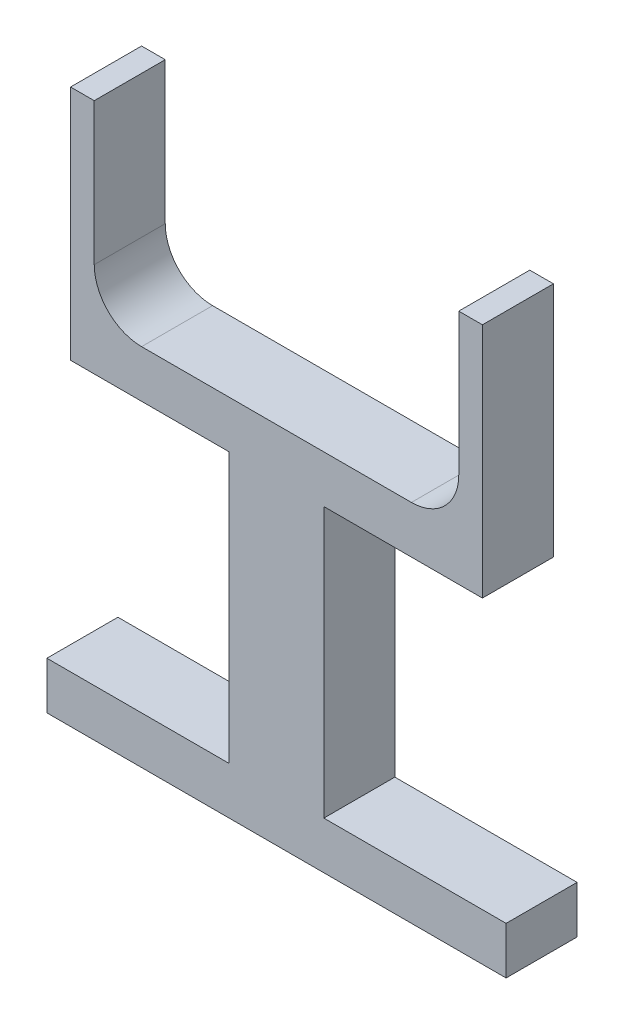
ISO-10303-21;
HEADER;
FILE_DESCRIPTION(('STEP AP214'),'2;1');
FILE_NAME('part.step','',(''),(''),'','','');
FILE_SCHEMA(('AUTOMOTIVE_DESIGN { 1 0 10303 214 1 1 1 1 }'));
ENDSEC;
DATA;
#1=APPLICATION_CONTEXT('core data for automotive mechanical design processes');
#2=APPLICATION_PROTOCOL_DEFINITION('international standard','automotive_design',2000,#1);
#3=PRODUCT_CONTEXT('',#1,'mechanical');
#4=PRODUCT('Part','Part','',(#3));
#5=PRODUCT_RELATED_PRODUCT_CATEGORY('part','',(#4));
#6=PRODUCT_DEFINITION_FORMATION('','',#4);
#7=PRODUCT_DEFINITION_CONTEXT('part definition',#1,'design');
#8=PRODUCT_DEFINITION('design','',#6,#7);
#9=PRODUCT_DEFINITION_SHAPE('','',#8);
#10=(LENGTH_UNIT() NAMED_UNIT(*) SI_UNIT(.MILLI.,.METRE.));
#11=(NAMED_UNIT(*) PLANE_ANGLE_UNIT() SI_UNIT($,.RADIAN.));
#12=(NAMED_UNIT(*) SI_UNIT($,.STERADIAN.) SOLID_ANGLE_UNIT());
#13=UNCERTAINTY_MEASURE_WITH_UNIT(LENGTH_MEASURE(1.E-05),#10,'distance_accuracy_value','');
#14=(GEOMETRIC_REPRESENTATION_CONTEXT(3) GLOBAL_UNCERTAINTY_ASSIGNED_CONTEXT((#13)) GLOBAL_UNIT_ASSIGNED_CONTEXT((#10,
#11,#12)) REPRESENTATION_CONTEXT('',''));
#15=CARTESIAN_POINT('',(0.,0.,0.));
#16=DIRECTION('',(0.,0.,1.));
#17=DIRECTION('',(1.,0.,0.));
#18=AXIS2_PLACEMENT_3D('',#15,#16,#17);
#19=CARTESIAN_POINT('',(-72.3723164960141,0.,15.));
#20=DIRECTION('',(-1.,0.,0.));
#21=DIRECTION('',(0.,-1.,0.));
#22=AXIS2_PLACEMENT_3D('',#19,#20,#21);
#23=PLANE('',#22);
#24=DIRECTION('',(0.,1.,0.));
#25=VECTOR('',#24,1.);
#26=CARTESIAN_POINT('',(-72.3723164960141,0.,0.));
#27=LINE('',#26,#25);
#28=CARTESIAN_POINT('',(-72.3723164960141,45.7704918032787,0.));
#29=VERTEX_POINT('',#28);
#30=CARTESIAN_POINT('',(-72.3723164960141,95.7704918032787,0.));
#31=VERTEX_POINT('',#30);
#32=EDGE_CURVE('E172',#29,#31,#27,.T.);
#33=ORIENTED_EDGE('',*,*,#32,.F.);
#34=DIRECTION('',(0.,0.,-1.));
#35=VECTOR('',#34,1.);
#36=CARTESIAN_POINT('',(-72.3723164960141,45.7704918032787,15.));
#37=LINE('',#36,#35);
#38=CARTESIAN_POINT('',(-72.3723164960141,45.7704918032787,15.));
#39=VERTEX_POINT('',#38);
#40=EDGE_CURVE('E166',#39,#29,#37,.T.);
#41=ORIENTED_EDGE('',*,*,#40,.F.);
#42=DIRECTION('',(0.,1.,0.));
#43=VECTOR('',#42,1.);
#44=CARTESIAN_POINT('',(-72.3723164960141,0.,15.));
#45=LINE('',#44,#43);
#46=CARTESIAN_POINT('',(-72.3723164960141,95.7704918032787,15.));
#47=VERTEX_POINT('',#46);
#48=EDGE_CURVE('E169',#39,#47,#45,.T.);
#49=ORIENTED_EDGE('',*,*,#48,.T.);
#50=DIRECTION('',(0.,0.,-1.));
#51=VECTOR('',#50,1.);
#52=CARTESIAN_POINT('',(-72.3723164960141,95.7704918032787,15.));
#53=LINE('',#52,#51);
#54=EDGE_CURVE('E240',#47,#31,#53,.T.);
#55=ORIENTED_EDGE('',*,*,#54,.T.);
#56=EDGE_LOOP('',(#33,#41,#49,#55));
#57=FACE_BOUND('',#56,.T.);
#58=ADVANCED_FACE('F41',(#57),#23,.T.);
#59=CARTESIAN_POINT('',(0.,45.7704918032787,15.));
#60=DIRECTION('',(0.,1.,0.));
#61=DIRECTION('',(0.,0.,1.));
#62=AXIS2_PLACEMENT_3D('',#59,#60,#61);
#63=PLANE('',#62);
#64=DIRECTION('',(1.,0.,0.));
#65=VECTOR('',#64,1.);
#66=CARTESIAN_POINT('',(0.,45.7704918032787,0.));
#67=LINE('',#66,#65);
#68=CARTESIAN_POINT('',(-38.8723164960141,45.7704918032787,0.));
#69=VERTEX_POINT('',#68);
#70=EDGE_CURVE('E243',#29,#69,#67,.T.);
#71=ORIENTED_EDGE('',*,*,#70,.T.);
#72=DIRECTION('',(0.,0.,-1.));
#73=VECTOR('',#72,1.);
#74=CARTESIAN_POINT('',(-38.8723164960141,45.7704918032787,15.));
#75=LINE('',#74,#73);
#76=CARTESIAN_POINT('',(-38.8723164960141,45.7704918032787,15.));
#77=VERTEX_POINT('',#76);
#78=EDGE_CURVE('E177',#77,#69,#75,.T.);
#79=ORIENTED_EDGE('',*,*,#78,.F.);
#80=DIRECTION('',(1.,0.,0.));
#81=VECTOR('',#80,1.);
#82=CARTESIAN_POINT('',(0.,45.7704918032787,15.));
#83=LINE('',#82,#81);
#84=EDGE_CURVE('E180',#39,#77,#83,.T.);
#85=ORIENTED_EDGE('',*,*,#84,.F.);
#86=ORIENTED_EDGE('',*,*,#40,.T.);
#87=EDGE_LOOP('',(#71,#79,#85,#86));
#88=FACE_BOUND('',#87,.T.);
#89=ADVANCED_FACE('F181',(#88),#63,.F.);
#90=CARTESIAN_POINT('',(-38.8723164960141,0.,15.));
#91=DIRECTION('',(1.,0.,0.));
#92=DIRECTION('',(0.,1.,0.));
#93=AXIS2_PLACEMENT_3D('',#90,#91,#92);
#94=PLANE('',#93);
#95=DIRECTION('',(0.,-1.,0.));
#96=VECTOR('',#95,1.);
#97=CARTESIAN_POINT('',(-38.8723164960141,0.,0.));
#98=LINE('',#97,#96);
#99=CARTESIAN_POINT('',(-38.8723164960141,-11.2295081967213,0.));
#100=VERTEX_POINT('',#99);
#101=EDGE_CURVE('E246',#69,#100,#98,.T.);
#102=ORIENTED_EDGE('',*,*,#101,.T.);
#103=DIRECTION('',(0.,0.,-1.));
#104=VECTOR('',#103,1.);
#105=CARTESIAN_POINT('',(-38.8723164960141,-11.2295081967213,15.));
#106=LINE('',#105,#104);
#107=CARTESIAN_POINT('',(-38.8723164960141,-11.2295081967213,15.));
#108=VERTEX_POINT('',#107);
#109=EDGE_CURVE('E323',#108,#100,#106,.T.);
#110=ORIENTED_EDGE('',*,*,#109,.F.);
#111=DIRECTION('',(0.,-1.,0.));
#112=VECTOR('',#111,1.);
#113=CARTESIAN_POINT('',(-38.8723164960141,0.,15.));
#114=LINE('',#113,#112);
#115=EDGE_CURVE('E185',#77,#108,#114,.T.);
#116=ORIENTED_EDGE('',*,*,#115,.F.);
#117=ORIENTED_EDGE('',*,*,#78,.T.);
#118=EDGE_LOOP('',(#102,#110,#116,#117));
#119=FACE_BOUND('',#118,.T.);
#120=ADVANCED_FACE('F361',(#119),#94,.F.);
#121=CARTESIAN_POINT('',(0.,-11.2295081967213,15.));
#122=DIRECTION('',(0.,1.,0.));
#123=DIRECTION('',(-1.,0.,0.));
#124=AXIS2_PLACEMENT_3D('',#121,#122,#123);
#125=PLANE('',#124);
#126=DIRECTION('',(1.,0.,0.));
#127=VECTOR('',#126,1.);
#128=CARTESIAN_POINT('',(0.,-11.2295081967213,0.));
#129=LINE('',#128,#127);
#130=CARTESIAN_POINT('',(-77.3723164960141,-11.2295081967213,0.));
#131=VERTEX_POINT('',#130);
#132=EDGE_CURVE('E251',#131,#100,#129,.T.);
#133=ORIENTED_EDGE('',*,*,#132,.F.);
#134=DIRECTION('',(0.,0.,-1.));
#135=VECTOR('',#134,1.);
#136=CARTESIAN_POINT('',(-77.3723164960141,-11.2295081967213,15.));
#137=LINE('',#136,#135);
#138=CARTESIAN_POINT('',(-77.3723164960141,-11.2295081967213,15.));
#139=VERTEX_POINT('',#138);
#140=EDGE_CURVE('E320',#139,#131,#137,.T.);
#141=ORIENTED_EDGE('',*,*,#140,.F.);
#142=DIRECTION('',(1.,0.,0.));
#143=VECTOR('',#142,1.);
#144=CARTESIAN_POINT('',(0.,-11.2295081967213,15.));
#145=LINE('',#144,#143);
#146=EDGE_CURVE('E201',#139,#108,#145,.T.);
#147=ORIENTED_EDGE('',*,*,#146,.T.);
#148=ORIENTED_EDGE('',*,*,#109,.T.);
#149=EDGE_LOOP('',(#133,#141,#147,#148));
#150=FACE_BOUND('',#149,.T.);
#151=ADVANCED_FACE('F368',(#150),#125,.T.);
#152=CARTESIAN_POINT('',(-77.3723164960141,0.,15.));
#153=DIRECTION('',(1.,0.,0.));
#154=DIRECTION('',(0.,0.,-1.));
#155=AXIS2_PLACEMENT_3D('',#152,#153,#154);
#156=PLANE('',#155);
#157=DIRECTION('',(0.,-1.,0.));
#158=VECTOR('',#157,1.);
#159=CARTESIAN_POINT('',(-77.3723164960141,0.,0.));
#160=LINE('',#159,#158);
#161=CARTESIAN_POINT('',(-77.3723164960141,-21.2295081967213,0.));
#162=VERTEX_POINT('',#161);
#163=EDGE_CURVE('E255',#131,#162,#160,.T.);
#164=ORIENTED_EDGE('',*,*,#163,.T.);
#165=DIRECTION('',(0.,0.,-1.));
#166=VECTOR('',#165,1.);
#167=CARTESIAN_POINT('',(-77.3723164960141,-21.2295081967213,15.));
#168=LINE('',#167,#166);
#169=CARTESIAN_POINT('',(-77.3723164960141,-21.2295081967213,15.));
#170=VERTEX_POINT('',#169);
#171=EDGE_CURVE('E316',#170,#162,#168,.T.);
#172=ORIENTED_EDGE('',*,*,#171,.F.);
#173=DIRECTION('',(0.,-1.,0.));
#174=VECTOR('',#173,1.);
#175=CARTESIAN_POINT('',(-77.3723164960141,0.,15.));
#176=LINE('',#175,#174);
#177=EDGE_CURVE('E205',#139,#170,#176,.T.);
#178=ORIENTED_EDGE('',*,*,#177,.F.);
#179=ORIENTED_EDGE('',*,*,#140,.T.);
#180=EDGE_LOOP('',(#164,#172,#178,#179));
#181=FACE_BOUND('',#180,.T.);
#182=ADVANCED_FACE('F371',(#181),#156,.F.);
#183=CARTESIAN_POINT('',(0.,-21.2295081967213,15.));
#184=DIRECTION('',(0.,1.,0.));
#185=DIRECTION('',(0.,0.,1.));
#186=AXIS2_PLACEMENT_3D('',#183,#184,#185);
#187=PLANE('',#186);
#188=DIRECTION('',(1.,0.,0.));
#189=VECTOR('',#188,1.);
#190=CARTESIAN_POINT('',(0.,-21.2295081967213,0.));
#191=LINE('',#190,#189);
#192=CARTESIAN_POINT('',(19.6276835039859,-21.2295081967213,0.));
#193=VERTEX_POINT('',#192);
#194=EDGE_CURVE('E259',#162,#193,#191,.T.);
#195=ORIENTED_EDGE('',*,*,#194,.T.);
#196=DIRECTION('',(0.,0.,-1.));
#197=VECTOR('',#196,1.);
#198=CARTESIAN_POINT('',(19.6276835039859,-21.2295081967213,15.));
#199=LINE('',#198,#197);
#200=CARTESIAN_POINT('',(19.6276835039859,-21.2295081967213,15.));
#201=VERTEX_POINT('',#200);
#202=EDGE_CURVE('E313',#201,#193,#199,.T.);
#203=ORIENTED_EDGE('',*,*,#202,.F.);
#204=DIRECTION('',(1.,0.,0.));
#205=VECTOR('',#204,1.);
#206=CARTESIAN_POINT('',(0.,-21.2295081967213,15.));
#207=LINE('',#206,#205);
#208=EDGE_CURVE('E209',#170,#201,#207,.T.);
#209=ORIENTED_EDGE('',*,*,#208,.F.);
#210=ORIENTED_EDGE('',*,*,#171,.T.);
#211=EDGE_LOOP('',(#195,#203,#209,#210));
#212=FACE_BOUND('',#211,.T.);
#213=ADVANCED_FACE('F376',(#212),#187,.F.);
#214=CARTESIAN_POINT('',(19.6276835039859,0.,15.));
#215=DIRECTION('',(1.,0.,0.));
#216=DIRECTION('',(0.,0.,-1.));
#217=AXIS2_PLACEMENT_3D('',#214,#215,#216);
#218=PLANE('',#217);
#219=DIRECTION('',(0.,-1.,0.));
#220=VECTOR('',#219,1.);
#221=CARTESIAN_POINT('',(19.6276835039859,0.,0.));
#222=LINE('',#221,#220);
#223=CARTESIAN_POINT('',(19.6276835039859,-11.2295081967213,0.));
#224=VERTEX_POINT('',#223);
#225=EDGE_CURVE('E263',#224,#193,#222,.T.);
#226=ORIENTED_EDGE('',*,*,#225,.F.);
#227=DIRECTION('',(0.,0.,-1.));
#228=VECTOR('',#227,1.);
#229=CARTESIAN_POINT('',(19.6276835039859,-11.2295081967213,15.));
#230=LINE('',#229,#228);
#231=CARTESIAN_POINT('',(19.6276835039859,-11.2295081967213,15.));
#232=VERTEX_POINT('',#231);
#233=EDGE_CURVE('E310',#232,#224,#230,.T.);
#234=ORIENTED_EDGE('',*,*,#233,.F.);
#235=DIRECTION('',(0.,-1.,0.));
#236=VECTOR('',#235,1.);
#237=CARTESIAN_POINT('',(19.6276835039859,0.,15.));
#238=LINE('',#237,#236);
#239=EDGE_CURVE('E212',#232,#201,#238,.T.);
#240=ORIENTED_EDGE('',*,*,#239,.T.);
#241=ORIENTED_EDGE('',*,*,#202,.T.);
#242=EDGE_LOOP('',(#226,#234,#240,#241));
#243=FACE_BOUND('',#242,.T.);
#244=ADVANCED_FACE('F417',(#243),#218,.T.);
#245=CARTESIAN_POINT('',(-18.8723164960141,-11.2295081967213,0.));
#246=VERTEX_POINT('',#245);
#247=EDGE_CURVE('E256',#246,#224,#129,.T.);
#248=ORIENTED_EDGE('',*,*,#247,.F.);
#249=DIRECTION('',(0.,0.,-1.));
#250=VECTOR('',#249,1.);
#251=CARTESIAN_POINT('',(-18.8723164960141,-11.2295081967213,15.));
#252=LINE('',#251,#250);
#253=CARTESIAN_POINT('',(-18.8723164960141,-11.2295081967213,15.));
#254=VERTEX_POINT('',#253);
#255=EDGE_CURVE('E307',#254,#246,#252,.T.);
#256=ORIENTED_EDGE('',*,*,#255,.F.);
#257=EDGE_CURVE('E206',#254,#232,#145,.T.);
#258=ORIENTED_EDGE('',*,*,#257,.T.);
#259=ORIENTED_EDGE('',*,*,#233,.T.);
#260=EDGE_LOOP('',(#248,#256,#258,#259));
#261=FACE_BOUND('',#260,.T.);
#262=ADVANCED_FACE('F384',(#261),#125,.T.);
#263=CARTESIAN_POINT('',(-18.8723164960141,0.,15.));
#264=DIRECTION('',(1.,0.,0.));
#265=DIRECTION('',(0.,1.,0.));
#266=AXIS2_PLACEMENT_3D('',#263,#264,#265);
#267=PLANE('',#266);
#268=DIRECTION('',(0.,-1.,0.));
#269=VECTOR('',#268,1.);
#270=CARTESIAN_POINT('',(-18.8723164960141,0.,0.));
#271=LINE('',#270,#269);
#272=CARTESIAN_POINT('',(-18.8723164960141,45.7704918032787,0.));
#273=VERTEX_POINT('',#272);
#274=EDGE_CURVE('E267',#273,#246,#271,.T.);
#275=ORIENTED_EDGE('',*,*,#274,.F.);
#276=DIRECTION('',(0.,0.,-1.));
#277=VECTOR('',#276,1.);
#278=CARTESIAN_POINT('',(-18.8723164960141,45.7704918032787,15.));
#279=LINE('',#278,#277);
#280=CARTESIAN_POINT('',(-18.8723164960141,45.7704918032787,15.));
#281=VERTEX_POINT('',#280);
#282=EDGE_CURVE('E304',#281,#273,#279,.T.);
#283=ORIENTED_EDGE('',*,*,#282,.F.);
#284=DIRECTION('',(0.,-1.,0.));
#285=VECTOR('',#284,1.);
#286=CARTESIAN_POINT('',(-18.8723164960141,0.,15.));
#287=LINE('',#286,#285);
#288=EDGE_CURVE('E216',#281,#254,#287,.T.);
#289=ORIENTED_EDGE('',*,*,#288,.T.);
#290=ORIENTED_EDGE('',*,*,#255,.T.);
#291=EDGE_LOOP('',(#275,#283,#289,#290));
#292=FACE_BOUND('',#291,.T.);
#293=ADVANCED_FACE('F415',(#292),#267,.T.);
#294=CARTESIAN_POINT('',(14.6276835039859,45.7704918032787,0.));
#295=VERTEX_POINT('',#294);
#296=EDGE_CURVE('E247',#273,#295,#67,.T.);
#297=ORIENTED_EDGE('',*,*,#296,.T.);
#298=DIRECTION('',(0.,0.,-1.));
#299=VECTOR('',#298,1.);
#300=CARTESIAN_POINT('',(14.6276835039859,45.7704918032787,15.));
#301=LINE('',#300,#299);
#302=CARTESIAN_POINT('',(14.6276835039859,45.7704918032787,15.));
#303=VERTEX_POINT('',#302);
#304=EDGE_CURVE('E301',#303,#295,#301,.T.);
#305=ORIENTED_EDGE('',*,*,#304,.F.);
#306=EDGE_CURVE('E187',#281,#303,#83,.T.);
#307=ORIENTED_EDGE('',*,*,#306,.F.);
#308=ORIENTED_EDGE('',*,*,#282,.T.);
#309=EDGE_LOOP('',(#297,#305,#307,#308));
#310=FACE_BOUND('',#309,.T.);
#311=ADVANCED_FACE('F393',(#310),#63,.F.);
#312=CARTESIAN_POINT('',(14.6276835039859,0.,15.));
#313=DIRECTION('',(1.,0.,0.));
#314=DIRECTION('',(0.,1.,0.));
#315=AXIS2_PLACEMENT_3D('',#312,#313,#314);
#316=PLANE('',#315);
#317=DIRECTION('',(0.,-1.,0.));
#318=VECTOR('',#317,1.);
#319=CARTESIAN_POINT('',(14.6276835039859,0.,0.));
#320=LINE('',#319,#318);
#321=CARTESIAN_POINT('',(14.6276835039859,95.7704918032787,0.));
#322=VERTEX_POINT('',#321);
#323=EDGE_CURVE('E271',#322,#295,#320,.T.);
#324=ORIENTED_EDGE('',*,*,#323,.F.);
#325=DIRECTION('',(0.,0.,-1.));
#326=VECTOR('',#325,1.);
#327=CARTESIAN_POINT('',(14.6276835039859,95.7704918032787,15.));
#328=LINE('',#327,#326);
#329=CARTESIAN_POINT('',(14.6276835039859,95.7704918032787,15.));
#330=VERTEX_POINT('',#329);
#331=EDGE_CURVE('E298',#330,#322,#328,.T.);
#332=ORIENTED_EDGE('',*,*,#331,.F.);
#333=DIRECTION('',(0.,-1.,0.));
#334=VECTOR('',#333,1.);
#335=CARTESIAN_POINT('',(14.6276835039859,0.,15.));
#336=LINE('',#335,#334);
#337=EDGE_CURVE('E220',#330,#303,#336,.T.);
#338=ORIENTED_EDGE('',*,*,#337,.T.);
#339=ORIENTED_EDGE('',*,*,#304,.T.);
#340=EDGE_LOOP('',(#324,#332,#338,#339));
#341=FACE_BOUND('',#340,.T.);
#342=ADVANCED_FACE('F397',(#341),#316,.T.);
#343=CARTESIAN_POINT('',(0.,95.7704918032787,15.));
#344=DIRECTION('',(0.,-1.,0.));
#345=DIRECTION('',(0.,0.,-1.));
#346=AXIS2_PLACEMENT_3D('',#343,#344,#345);
#347=PLANE('',#346);
#348=DIRECTION('',(-1.,0.,0.));
#349=VECTOR('',#348,1.);
#350=CARTESIAN_POINT('',(0.,95.7704918032787,0.));
#351=LINE('',#350,#349);
#352=CARTESIAN_POINT('',(9.62768350398589,95.7704918032787,0.));
#353=VERTEX_POINT('',#352);
#354=EDGE_CURVE('E275',#322,#353,#351,.T.);
#355=ORIENTED_EDGE('',*,*,#354,.T.);
#356=DIRECTION('',(0.,0.,-1.));
#357=VECTOR('',#356,1.);
#358=CARTESIAN_POINT('',(9.62768350398589,95.7704918032787,15.));
#359=LINE('',#358,#357);
#360=CARTESIAN_POINT('',(9.62768350398589,95.7704918032787,15.));
#361=VERTEX_POINT('',#360);
#362=EDGE_CURVE('E294',#361,#353,#359,.T.);
#363=ORIENTED_EDGE('',*,*,#362,.F.);
#364=DIRECTION('',(-1.,0.,0.));
#365=VECTOR('',#364,1.);
#366=CARTESIAN_POINT('',(0.,95.7704918032787,15.));
#367=LINE('',#366,#365);
#368=EDGE_CURVE('E224',#330,#361,#367,.T.);
#369=ORIENTED_EDGE('',*,*,#368,.F.);
#370=ORIENTED_EDGE('',*,*,#331,.T.);
#371=EDGE_LOOP('',(#355,#363,#369,#370));
#372=FACE_BOUND('',#371,.T.);
#373=ADVANCED_FACE('F402',(#372),#347,.F.);
#374=CARTESIAN_POINT('',(9.62768350398589,0.,15.));
#375=DIRECTION('',(-1.,0.,0.));
#376=DIRECTION('',(0.,0.,1.));
#377=AXIS2_PLACEMENT_3D('',#374,#375,#376);
#378=PLANE('',#377);
#379=DIRECTION('',(0.,1.,0.));
#380=VECTOR('',#379,1.);
#381=CARTESIAN_POINT('',(9.62768350398589,0.,0.));
#382=LINE('',#381,#380);
#383=CARTESIAN_POINT('',(9.62768350398589,65.7704918032787,0.));
#384=VERTEX_POINT('',#383);
#385=EDGE_CURVE('E279',#384,#353,#382,.T.);
#386=ORIENTED_EDGE('',*,*,#385,.F.);
#387=DIRECTION('',(0.,0.,-1.));
#388=VECTOR('',#387,1.);
#389=CARTESIAN_POINT('',(9.62768350398589,65.7704918032787,15.));
#390=LINE('',#389,#388);
#391=CARTESIAN_POINT('',(9.62768350398589,65.7704918032787,15.));
#392=VERTEX_POINT('',#391);
#393=EDGE_CURVE('E334',#384,#392,#390,.F.);
#394=ORIENTED_EDGE('',*,*,#393,.T.);
#395=DIRECTION('',(0.,1.,0.));
#396=VECTOR('',#395,1.);
#397=CARTESIAN_POINT('',(9.62768350398589,0.,15.));
#398=LINE('',#397,#396);
#399=EDGE_CURVE('E228',#392,#361,#398,.T.);
#400=ORIENTED_EDGE('',*,*,#399,.T.);
#401=ORIENTED_EDGE('',*,*,#362,.T.);
#402=EDGE_LOOP('',(#386,#394,#400,#401));
#403=FACE_BOUND('',#402,.T.);
#404=ADVANCED_FACE('F410',(#403),#378,.T.);
#405=CARTESIAN_POINT('',(0.,55.7704918032787,15.));
#406=DIRECTION('',(0.,1.,0.));
#407=DIRECTION('',(0.,0.,1.));
#408=AXIS2_PLACEMENT_3D('',#405,#406,#407);
#409=PLANE('',#408);
#410=DIRECTION('',(1.,0.,0.));
#411=VECTOR('',#410,1.);
#412=CARTESIAN_POINT('',(0.,55.7704918032787,15.));
#413=LINE('',#412,#411);
#414=CARTESIAN_POINT('',(-57.3723164960141,55.7704918032787,15.));
#415=VERTEX_POINT('',#414);
#416=CARTESIAN_POINT('',(-0.372316496014108,55.7704918032787,15.));
#417=VERTEX_POINT('',#416);
#418=EDGE_CURVE('E231',#415,#417,#413,.T.);
#419=ORIENTED_EDGE('',*,*,#418,.T.);
#420=DIRECTION('',(0.,0.,-1.));
#421=VECTOR('',#420,1.);
#422=CARTESIAN_POINT('',(-0.372316496014108,55.7704918032787,0.));
#423=LINE('',#422,#421);
#424=CARTESIAN_POINT('',(-0.372316496014108,55.7704918032787,0.));
#425=VERTEX_POINT('',#424);
#426=EDGE_CURVE('E330',#417,#425,#423,.T.);
#427=ORIENTED_EDGE('',*,*,#426,.T.);
#428=DIRECTION('',(1.,0.,0.));
#429=VECTOR('',#428,1.);
#430=CARTESIAN_POINT('',(0.,55.7704918032787,0.));
#431=LINE('',#430,#429);
#432=CARTESIAN_POINT('',(-57.3723164960141,55.7704918032787,0.));
#433=VERTEX_POINT('',#432);
#434=EDGE_CURVE('E282',#433,#425,#431,.T.);
#435=ORIENTED_EDGE('',*,*,#434,.F.);
#436=DIRECTION('',(0.,0.,-1.));
#437=VECTOR('',#436,1.);
#438=CARTESIAN_POINT('',(-57.3723164960141,55.7704918032787,15.));
#439=LINE('',#438,#437);
#440=EDGE_CURVE('E176',#433,#415,#439,.F.);
#441=ORIENTED_EDGE('',*,*,#440,.T.);
#442=EDGE_LOOP('',(#419,#427,#435,#441));
#443=FACE_BOUND('',#442,.T.);
#444=ADVANCED_FACE('F351',(#443),#409,.T.);
#445=CARTESIAN_POINT('',(-67.3723164960141,0.,15.));
#446=DIRECTION('',(-1.,0.,0.));
#447=DIRECTION('',(0.,0.,1.));
#448=AXIS2_PLACEMENT_3D('',#445,#446,#447);
#449=PLANE('',#448);
#450=DIRECTION('',(0.,1.,0.));
#451=VECTOR('',#450,1.);
#452=CARTESIAN_POINT('',(-67.3723164960141,0.,15.));
#453=LINE('',#452,#451);
#454=CARTESIAN_POINT('',(-67.3723164960141,65.7704918032787,15.));
#455=VERTEX_POINT('',#454);
#456=CARTESIAN_POINT('',(-67.3723164960141,95.7704918032787,15.));
#457=VERTEX_POINT('',#456);
#458=EDGE_CURVE('E235',#455,#457,#453,.T.);
#459=ORIENTED_EDGE('',*,*,#458,.F.);
#460=DIRECTION('',(0.,0.,-1.));
#461=VECTOR('',#460,1.);
#462=CARTESIAN_POINT('',(-67.3723164960141,65.7704918032787,15.));
#463=LINE('',#462,#461);
#464=CARTESIAN_POINT('',(-67.3723164960141,65.7704918032787,0.));
#465=VERTEX_POINT('',#464);
#466=EDGE_CURVE('E337',#455,#465,#463,.T.);
#467=ORIENTED_EDGE('',*,*,#466,.T.);
#468=DIRECTION('',(0.,1.,0.));
#469=VECTOR('',#468,1.);
#470=CARTESIAN_POINT('',(-67.3723164960141,0.,0.));
#471=LINE('',#470,#469);
#472=CARTESIAN_POINT('',(-67.3723164960141,95.7704918032787,0.));
#473=VERTEX_POINT('',#472);
#474=EDGE_CURVE('E196',#465,#473,#471,.T.);
#475=ORIENTED_EDGE('',*,*,#474,.T.);
#476=DIRECTION('',(0.,0.,-1.));
#477=VECTOR('',#476,1.);
#478=CARTESIAN_POINT('',(-67.3723164960141,95.7704918032787,15.));
#479=LINE('',#478,#477);
#480=EDGE_CURVE('E290',#457,#473,#479,.T.);
#481=ORIENTED_EDGE('',*,*,#480,.F.);
#482=EDGE_LOOP('',(#459,#467,#475,#481));
#483=FACE_BOUND('',#482,.T.);
#484=ADVANCED_FACE('F354',(#483),#449,.F.);
#485=CARTESIAN_POINT('',(0.,95.7704918032787,15.));
#486=DIRECTION('',(0.,1.,0.));
#487=DIRECTION('',(0.,0.,1.));
#488=AXIS2_PLACEMENT_3D('',#485,#486,#487);
#489=PLANE('',#488);
#490=DIRECTION('',(1.,0.,0.));
#491=VECTOR('',#490,1.);
#492=CARTESIAN_POINT('',(0.,95.7704918032787,0.));
#493=LINE('',#492,#491);
#494=EDGE_CURVE('E192',#31,#473,#493,.T.);
#495=ORIENTED_EDGE('',*,*,#494,.F.);
#496=ORIENTED_EDGE('',*,*,#54,.F.);
#497=DIRECTION('',(1.,0.,0.));
#498=VECTOR('',#497,1.);
#499=CARTESIAN_POINT('',(0.,95.7704918032787,15.));
#500=LINE('',#499,#498);
#501=EDGE_CURVE('E190',#47,#457,#500,.T.);
#502=ORIENTED_EDGE('',*,*,#501,.T.);
#503=ORIENTED_EDGE('',*,*,#480,.T.);
#504=EDGE_LOOP('',(#495,#496,#502,#503));
#505=FACE_BOUND('',#504,.T.);
#506=ADVANCED_FACE('F358',(#505),#489,.T.);
#507=CARTESIAN_POINT('',(0.,0.,15.));
#508=DIRECTION('',(0.,0.,1.));
#509=DIRECTION('',(1.,0.,0.));
#510=AXIS2_PLACEMENT_3D('',#507,#508,#509);
#511=PLANE('',#510);
#512=ORIENTED_EDGE('',*,*,#48,.F.);
#513=ORIENTED_EDGE('',*,*,#84,.T.);
#514=ORIENTED_EDGE('',*,*,#115,.T.);
#515=ORIENTED_EDGE('',*,*,#146,.F.);
#516=ORIENTED_EDGE('',*,*,#177,.T.);
#517=ORIENTED_EDGE('',*,*,#208,.T.);
#518=ORIENTED_EDGE('',*,*,#239,.F.);
#519=ORIENTED_EDGE('',*,*,#257,.F.);
#520=ORIENTED_EDGE('',*,*,#288,.F.);
#521=ORIENTED_EDGE('',*,*,#306,.T.);
#522=ORIENTED_EDGE('',*,*,#337,.F.);
#523=ORIENTED_EDGE('',*,*,#368,.T.);
#524=ORIENTED_EDGE('',*,*,#399,.F.);
#525=CARTESIAN_POINT('',(-0.372316496014108,65.7704918032787,15.));
#526=DIRECTION('',(0.,0.,1.));
#527=DIRECTION('',(1.,0.,0.));
#528=AXIS2_PLACEMENT_3D('',#525,#526,#527);
#529=CIRCLE('',#528,10.);
#530=EDGE_CURVE('E343',#392,#417,#529,.F.);
#531=ORIENTED_EDGE('',*,*,#530,.T.);
#532=ORIENTED_EDGE('',*,*,#418,.F.);
#533=CARTESIAN_POINT('',(-57.3723164960141,65.7704918032787,15.));
#534=DIRECTION('',(0.,0.,1.));
#535=DIRECTION('',(1.,0.,0.));
#536=AXIS2_PLACEMENT_3D('',#533,#534,#535);
#537=CIRCLE('',#536,10.);
#538=EDGE_CURVE('E11',#415,#455,#537,.F.);
#539=ORIENTED_EDGE('',*,*,#538,.T.);
#540=ORIENTED_EDGE('',*,*,#458,.T.);
#541=ORIENTED_EDGE('',*,*,#501,.F.);
#542=EDGE_LOOP('',(#512,#513,#514,#515,#516,#517,#518,#519,#520,#521,#522,#523,#524,#531,#532,
#539,#540,#541));
#543=FACE_BOUND('',#542,.T.);
#544=ADVANCED_FACE('F188',(#543),#511,.T.);
#545=CARTESIAN_POINT('',(0.,0.,0.));
#546=DIRECTION('',(0.,0.,1.));
#547=DIRECTION('',(1.,0.,0.));
#548=AXIS2_PLACEMENT_3D('',#545,#546,#547);
#549=PLANE('',#548);
#550=ORIENTED_EDGE('',*,*,#32,.T.);
#551=ORIENTED_EDGE('',*,*,#494,.T.);
#552=ORIENTED_EDGE('',*,*,#474,.F.);
#553=CARTESIAN_POINT('',(-57.3723164960141,65.7704918032787,0.));
#554=DIRECTION('',(0.,0.,1.));
#555=DIRECTION('',(1.,0.,0.));
#556=AXIS2_PLACEMENT_3D('',#553,#554,#555);
#557=CIRCLE('',#556,10.);
#558=EDGE_CURVE('E50',#465,#433,#557,.T.);
#559=ORIENTED_EDGE('',*,*,#558,.T.);
#560=ORIENTED_EDGE('',*,*,#434,.T.);
#561=CARTESIAN_POINT('',(-0.372316496014108,65.7704918032787,0.));
#562=DIRECTION('',(0.,0.,1.));
#563=DIRECTION('',(1.,0.,0.));
#564=AXIS2_PLACEMENT_3D('',#561,#562,#563);
#565=CIRCLE('',#564,10.);
#566=EDGE_CURVE('E340',#425,#384,#565,.T.);
#567=ORIENTED_EDGE('',*,*,#566,.T.);
#568=ORIENTED_EDGE('',*,*,#385,.T.);
#569=ORIENTED_EDGE('',*,*,#354,.F.);
#570=ORIENTED_EDGE('',*,*,#323,.T.);
#571=ORIENTED_EDGE('',*,*,#296,.F.);
#572=ORIENTED_EDGE('',*,*,#274,.T.);
#573=ORIENTED_EDGE('',*,*,#247,.T.);
#574=ORIENTED_EDGE('',*,*,#225,.T.);
#575=ORIENTED_EDGE('',*,*,#194,.F.);
#576=ORIENTED_EDGE('',*,*,#163,.F.);
#577=ORIENTED_EDGE('',*,*,#132,.T.);
#578=ORIENTED_EDGE('',*,*,#101,.F.);
#579=ORIENTED_EDGE('',*,*,#70,.F.);
#580=EDGE_LOOP('',(#550,#551,#552,#559,#560,#567,#568,#569,#570,#571,#572,#573,#574,#575,#576,
#577,#578,#579));
#581=FACE_BOUND('',#580,.T.);
#582=ADVANCED_FACE('F349',(#581),#549,.F.);
#583=CARTESIAN_POINT('',(-0.372316496014108,65.7704918032787,15.));
#584=DIRECTION('',(0.,0.,1.));
#585=DIRECTION('',(1.,0.,0.));
#586=AXIS2_PLACEMENT_3D('',#583,#584,#585);
#587=CYLINDRICAL_SURFACE('',#586,10.);
#588=ORIENTED_EDGE('',*,*,#530,.F.);
#589=ORIENTED_EDGE('',*,*,#393,.F.);
#590=ORIENTED_EDGE('',*,*,#566,.F.);
#591=ORIENTED_EDGE('',*,*,#426,.F.);
#592=EDGE_LOOP('',(#588,#589,#590,#591));
#593=FACE_BOUND('',#592,.T.);
#594=ADVANCED_FACE('F408',(#593),#587,.F.);
#595=CARTESIAN_POINT('',(-57.3723164960141,65.7704918032787,15.));
#596=DIRECTION('',(0.,0.,-1.));
#597=DIRECTION('',(-1.,0.,0.));
#598=AXIS2_PLACEMENT_3D('',#595,#596,#597);
#599=CYLINDRICAL_SURFACE('',#598,10.);
#600=ORIENTED_EDGE('',*,*,#538,.F.);
#601=ORIENTED_EDGE('',*,*,#440,.F.);
#602=ORIENTED_EDGE('',*,*,#558,.F.);
#603=ORIENTED_EDGE('',*,*,#466,.F.);
#604=EDGE_LOOP('',(#600,#601,#602,#603));
#605=FACE_BOUND('',#604,.T.);
#606=ADVANCED_FACE('F43',(#605),#599,.F.);
#607=CLOSED_SHELL('',(#58,#89,#120,#151,#182,#213,#244,#262,#293,#311,#342,#373,#404,#444,#484,
#506,#544,#582,#594,#606));
#608=MANIFOLD_SOLID_BREP('B2',#607);
#609=ADVANCED_BREP_SHAPE_REPRESENTATION('',(#18,#608),#14);
#610=SHAPE_DEFINITION_REPRESENTATION(#9,#609);
ENDSEC;
END-ISO-10303-21;
